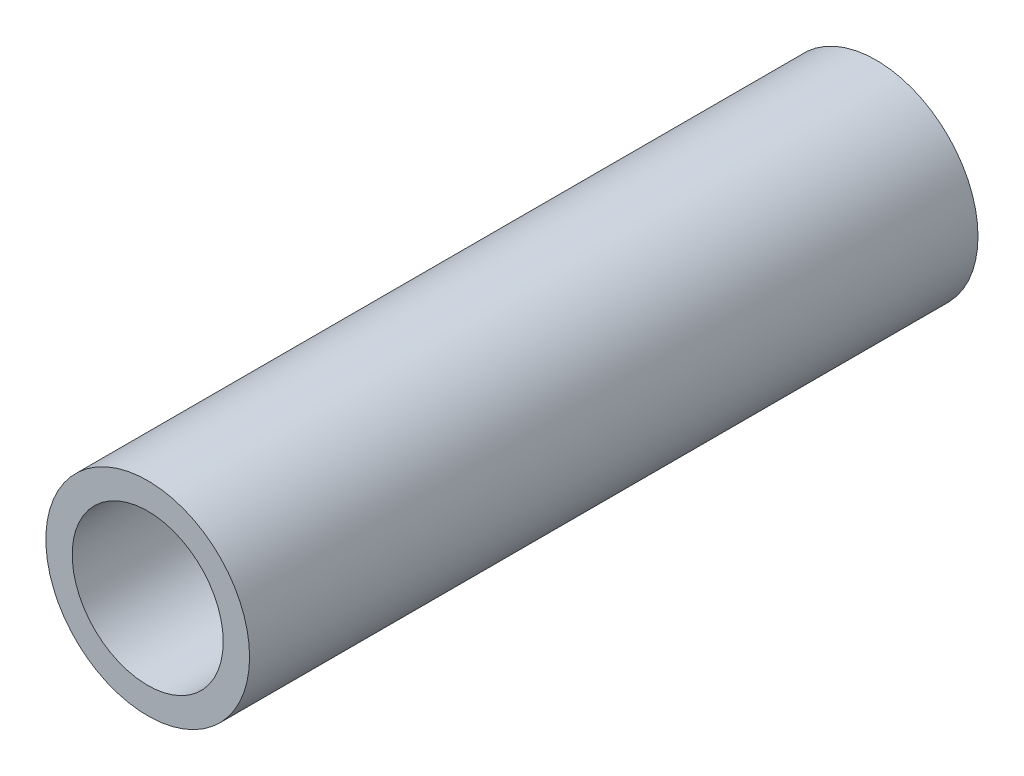
ISO-10303-21;
HEADER;
FILE_DESCRIPTION(('STEP AP214'),'2;1');
FILE_NAME('part.step','',(''),(''),'','','');
FILE_SCHEMA(('AUTOMOTIVE_DESIGN { 1 0 10303 214 1 1 1 1 }'));
ENDSEC;
DATA;
#1=APPLICATION_CONTEXT('core data for automotive mechanical design processes');
#2=APPLICATION_PROTOCOL_DEFINITION('international standard','automotive_design',2000,#1);
#3=PRODUCT_CONTEXT('',#1,'mechanical');
#4=PRODUCT('Part','Part','',(#3));
#5=PRODUCT_RELATED_PRODUCT_CATEGORY('part','',(#4));
#6=PRODUCT_DEFINITION_FORMATION('','',#4);
#7=PRODUCT_DEFINITION_CONTEXT('part definition',#1,'design');
#8=PRODUCT_DEFINITION('design','',#6,#7);
#9=PRODUCT_DEFINITION_SHAPE('','',#8);
#10=(LENGTH_UNIT() NAMED_UNIT(*) SI_UNIT(.MILLI.,.METRE.));
#11=(NAMED_UNIT(*) PLANE_ANGLE_UNIT() SI_UNIT($,.RADIAN.));
#12=(NAMED_UNIT(*) SI_UNIT($,.STERADIAN.) SOLID_ANGLE_UNIT());
#13=UNCERTAINTY_MEASURE_WITH_UNIT(LENGTH_MEASURE(1.E-05),#10,'distance_accuracy_value','');
#14=(GEOMETRIC_REPRESENTATION_CONTEXT(3) GLOBAL_UNCERTAINTY_ASSIGNED_CONTEXT((#13)) GLOBAL_UNIT_ASSIGNED_CONTEXT((#10,
#11,#12)) REPRESENTATION_CONTEXT('',''));
#15=CARTESIAN_POINT('',(0.,0.,0.));
#16=DIRECTION('',(0.,0.,1.));
#17=DIRECTION('',(1.,0.,0.));
#18=AXIS2_PLACEMENT_3D('',#15,#16,#17);
#19=CARTESIAN_POINT('',(0.,0.,76.2));
#20=DIRECTION('',(0.,0.,1.));
#21=DIRECTION('',(1.,0.,0.));
#22=AXIS2_PLACEMENT_3D('',#19,#20,#21);
#23=PLANE('',#22);
#24=CARTESIAN_POINT('',(0.,0.,76.2));
#25=DIRECTION('',(0.,0.,1.));
#26=DIRECTION('',(1.,0.,0.));
#27=AXIS2_PLACEMENT_3D('',#24,#25,#26);
#28=CIRCLE('',#27,10.6553);
#29=CARTESIAN_POINT('',(10.6553,0.,76.2));
#30=VERTEX_POINT('',#29);
#31=EDGE_CURVE('E10',#30,#30,#28,.T.);
#32=ORIENTED_EDGE('',*,*,#31,.T.);
#33=EDGE_LOOP('',(#32));
#34=FACE_BOUND('',#33,.T.);
#35=CARTESIAN_POINT('',(0.,0.,76.2));
#36=DIRECTION('',(0.,0.,1.));
#37=DIRECTION('',(1.,0.,0.));
#38=AXIS2_PLACEMENT_3D('',#35,#36,#37);
#39=CIRCLE('',#38,7.8994);
#40=CARTESIAN_POINT('',(7.8994,0.,76.2));
#41=VERTEX_POINT('',#40);
#42=EDGE_CURVE('E42',#41,#41,#39,.T.);
#43=ORIENTED_EDGE('',*,*,#42,.F.);
#44=EDGE_LOOP('',(#43));
#45=FACE_BOUND('',#44,.T.);
#46=ADVANCED_FACE('F31',(#34,#45),#23,.T.);
#47=CARTESIAN_POINT('',(0.,0.,0.));
#48=DIRECTION('',(0.,0.,1.));
#49=DIRECTION('',(1.,0.,0.));
#50=AXIS2_PLACEMENT_3D('',#47,#48,#49);
#51=PLANE('',#50);
#52=CARTESIAN_POINT('',(0.,0.,0.));
#53=DIRECTION('',(0.,0.,1.));
#54=DIRECTION('',(1.,0.,0.));
#55=AXIS2_PLACEMENT_3D('',#52,#53,#54);
#56=CIRCLE('',#55,10.6553);
#57=CARTESIAN_POINT('',(10.6553,0.,0.));
#58=VERTEX_POINT('',#57);
#59=EDGE_CURVE('E35',#58,#58,#56,.T.);
#60=ORIENTED_EDGE('',*,*,#59,.F.);
#61=EDGE_LOOP('',(#60));
#62=FACE_BOUND('',#61,.T.);
#63=CARTESIAN_POINT('',(0.,0.,0.));
#64=DIRECTION('',(0.,0.,1.));
#65=DIRECTION('',(1.,0.,0.));
#66=AXIS2_PLACEMENT_3D('',#63,#64,#65);
#67=CIRCLE('',#66,7.8994);
#68=CARTESIAN_POINT('',(7.8994,0.,0.));
#69=VERTEX_POINT('',#68);
#70=EDGE_CURVE('E44',#69,#69,#67,.T.);
#71=ORIENTED_EDGE('',*,*,#70,.T.);
#72=EDGE_LOOP('',(#71));
#73=FACE_BOUND('',#72,.T.);
#74=ADVANCED_FACE('F54',(#62,#73),#51,.F.);
#75=CARTESIAN_POINT('',(0.,0.,76.2));
#76=DIRECTION('',(0.,0.,-1.));
#77=DIRECTION('',(-1.,0.,0.));
#78=AXIS2_PLACEMENT_3D('',#75,#76,#77);
#79=CYLINDRICAL_SURFACE('',#78,10.6553);
#80=ORIENTED_EDGE('',*,*,#31,.F.);
#81=EDGE_LOOP('',(#80));
#82=FACE_BOUND('',#81,.T.);
#83=ORIENTED_EDGE('',*,*,#59,.T.);
#84=EDGE_LOOP('',(#83));
#85=FACE_BOUND('',#84,.T.);
#86=ADVANCED_FACE('F33',(#82,#85),#79,.T.);
#87=CARTESIAN_POINT('',(0.,0.,76.2));
#88=DIRECTION('',(0.,0.,-1.));
#89=DIRECTION('',(-1.,0.,0.));
#90=AXIS2_PLACEMENT_3D('',#87,#88,#89);
#91=CYLINDRICAL_SURFACE('',#90,7.8994);
#92=ORIENTED_EDGE('',*,*,#42,.T.);
#93=EDGE_LOOP('',(#92));
#94=FACE_BOUND('',#93,.T.);
#95=ORIENTED_EDGE('',*,*,#70,.F.);
#96=EDGE_LOOP('',(#95));
#97=FACE_BOUND('',#96,.T.);
#98=ADVANCED_FACE('F50',(#94,#97),#91,.F.);
#99=CLOSED_SHELL('',(#46,#74,#86,#98));
#100=MANIFOLD_SOLID_BREP('B2',#99);
#101=ADVANCED_BREP_SHAPE_REPRESENTATION('',(#18,#100),#14);
#102=SHAPE_DEFINITION_REPRESENTATION(#9,#101);
ENDSEC;
END-ISO-10303-21;
